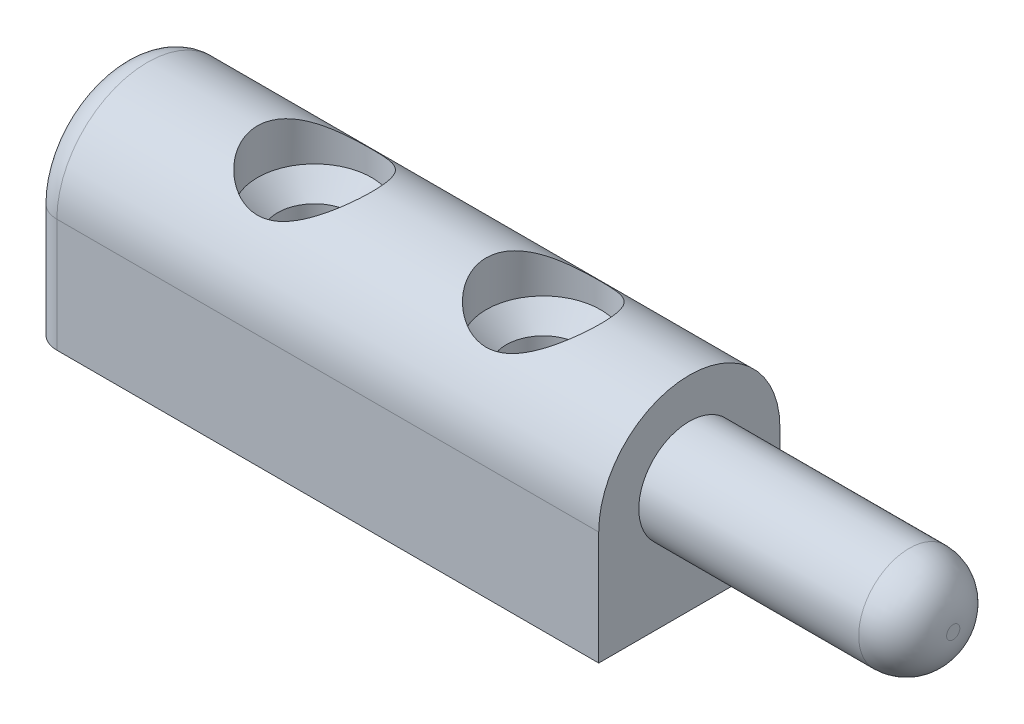
ISO-10303-21;
HEADER;
FILE_DESCRIPTION(('STEP AP214'),'2;1');
FILE_NAME('part.step','',(''),(''),'','','');
FILE_SCHEMA(('AUTOMOTIVE_DESIGN { 1 0 10303 214 1 1 1 1 }'));
ENDSEC;
DATA;
#1=APPLICATION_CONTEXT('core data for automotive mechanical design processes');
#2=APPLICATION_PROTOCOL_DEFINITION('international standard','automotive_design',2000,#1);
#3=PRODUCT_CONTEXT('',#1,'mechanical');
#4=PRODUCT('Part','Part','',(#3));
#5=PRODUCT_RELATED_PRODUCT_CATEGORY('part','',(#4));
#6=PRODUCT_DEFINITION_FORMATION('','',#4);
#7=PRODUCT_DEFINITION_CONTEXT('part definition',#1,'design');
#8=PRODUCT_DEFINITION('design','',#6,#7);
#9=PRODUCT_DEFINITION_SHAPE('','',#8);
#10=(LENGTH_UNIT() NAMED_UNIT(*) SI_UNIT(.MILLI.,.METRE.));
#11=(NAMED_UNIT(*) PLANE_ANGLE_UNIT() SI_UNIT($,.RADIAN.));
#12=(NAMED_UNIT(*) SI_UNIT($,.STERADIAN.) SOLID_ANGLE_UNIT());
#13=UNCERTAINTY_MEASURE_WITH_UNIT(LENGTH_MEASURE(1.E-05),#10,'distance_accuracy_value','');
#14=(GEOMETRIC_REPRESENTATION_CONTEXT(3) GLOBAL_UNCERTAINTY_ASSIGNED_CONTEXT((#13)) GLOBAL_UNIT_ASSIGNED_CONTEXT((#10,
#11,#12)) REPRESENTATION_CONTEXT('',''));
#15=CARTESIAN_POINT('',(0.,0.,0.));
#16=DIRECTION('',(0.,0.,1.));
#17=DIRECTION('',(1.,0.,0.));
#18=AXIS2_PLACEMENT_3D('',#15,#16,#17);
#19=CARTESIAN_POINT('',(16.15,0.,0.));
#20=DIRECTION('',(1.,0.,0.));
#21=DIRECTION('',(0.,0.,-1.));
#22=AXIS2_PLACEMENT_3D('',#19,#20,#21);
#23=PLANE('',#22);
#24=CARTESIAN_POINT('',(16.15,0.,0.));
#25=DIRECTION('',(1.,0.,0.));
#26=DIRECTION('',(0.,0.,-1.));
#27=AXIS2_PLACEMENT_3D('',#24,#25,#26);
#28=CIRCLE('',#27,5.15);
#29=CARTESIAN_POINT('',(16.15,0.,-5.15));
#30=VERTEX_POINT('',#29);
#31=CARTESIAN_POINT('',(16.15,0.,5.15));
#32=VERTEX_POINT('',#31);
#33=EDGE_CURVE('E93',#30,#32,#28,.T.);
#34=ORIENTED_EDGE('',*,*,#33,.T.);
#35=DIRECTION('',(0.,-1.,0.));
#36=VECTOR('',#35,1.);
#37=CARTESIAN_POINT('',(16.15,-6.45019379553824,5.15));
#38=LINE('',#37,#36);
#39=CARTESIAN_POINT('',(16.15,-6.45019379553824,5.15));
#40=VERTEX_POINT('',#39);
#41=EDGE_CURVE('E85',#32,#40,#38,.T.);
#42=ORIENTED_EDGE('',*,*,#41,.T.);
#43=DIRECTION('',(0.,0.,-1.));
#44=VECTOR('',#43,1.);
#45=CARTESIAN_POINT('',(16.15,-6.45019379553824,-5.15));
#46=LINE('',#45,#44);
#47=CARTESIAN_POINT('',(16.15,-6.45019379553824,-5.15));
#48=VERTEX_POINT('',#47);
#49=EDGE_CURVE('E92',#40,#48,#46,.T.);
#50=ORIENTED_EDGE('',*,*,#49,.T.);
#51=DIRECTION('',(0.,1.,0.));
#52=VECTOR('',#51,1.);
#53=CARTESIAN_POINT('',(16.15,-6.45019379553824,-5.15));
#54=LINE('',#53,#52);
#55=EDGE_CURVE('E98',#48,#30,#54,.T.);
#56=ORIENTED_EDGE('',*,*,#55,.T.);
#57=EDGE_LOOP('',(#34,#42,#50,#56));
#58=FACE_BOUND('',#57,.T.);
#59=CARTESIAN_POINT('',(16.15,0.,0.));
#60=DIRECTION('',(1.,0.,0.));
#61=DIRECTION('',(0.,0.,-1.));
#62=AXIS2_PLACEMENT_3D('',#59,#60,#61);
#63=CIRCLE('',#62,2.875);
#64=CARTESIAN_POINT('',(16.15,0.,-2.875));
#65=VERTEX_POINT('',#64);
#66=EDGE_CURVE('E221',#65,#65,#63,.T.);
#67=ORIENTED_EDGE('',*,*,#66,.F.);
#68=EDGE_LOOP('',(#67));
#69=FACE_BOUND('',#68,.T.);
#70=ADVANCED_FACE('F32',(#58,#69),#23,.T.);
#71=CARTESIAN_POINT('',(-5.15,5.15,0.));
#72=DIRECTION('',(0.,-1.,0.));
#73=DIRECTION('',(0.,0.,-1.));
#74=AXIS2_PLACEMENT_3D('',#71,#72,#73);
#75=CYLINDRICAL_SURFACE('',#74,3.25);
#76=CARTESIAN_POINT('',(-5.15,2.59980620446174,0.));
#77=DIRECTION('',(0.,1.,0.));
#78=DIRECTION('',(0.,0.,1.));
#79=AXIS2_PLACEMENT_3D('',#76,#77,#78);
#80=CIRCLE('',#79,3.25);
#81=CARTESIAN_POINT('',(-5.15,2.59980620446174,3.25));
#82=VERTEX_POINT('',#81);
#83=EDGE_CURVE('E138',#82,#82,#80,.F.);
#84=ORIENTED_EDGE('',*,*,#83,.T.);
#85=EDGE_LOOP('',(#84));
#86=FACE_BOUND('',#85,.T.);
#87=CARTESIAN_POINT('',(-8.4,5.15,0.));
#88=CARTESIAN_POINT('',(-8.40000001474633,5.15000000420325,-0.0824631102301969));
#89=CARTESIAN_POINT('',(-8.3968573318001,5.14801501046899,-0.164926473400708));
#90=CARTESIAN_POINT('',(-8.38433241643392,5.14012478994622,-0.329218697010087));
#91=CARTESIAN_POINT('',(-8.37494770422599,5.13421800513873,-0.41104729219725));
#92=CARTESIAN_POINT('',(-8.35005383138732,5.11861793148003,-0.573511125565467));
#93=CARTESIAN_POINT('',(-8.33453680503763,5.10891977973932,-0.654144692565212));
#94=CARTESIAN_POINT('',(-8.29759488640724,5.08597559790391,-0.81354337110015));
#95=CARTESIAN_POINT('',(-8.2761674940984,5.07272806652374,-0.892307676609958));
#96=CARTESIAN_POINT('',(-8.20365942007119,5.02825575256356,-1.12415930018388));
#97=CARTESIAN_POINT('',(-8.144196462155,4.99220026757494,-1.27379915933417));
#98=CARTESIAN_POINT('',(-8.00537866423584,4.91019990402799,-1.56036223857413));
#99=CARTESIAN_POINT('',(-7.926025406428,4.86425581211051,-1.69728646895532));
#100=CARTESIAN_POINT('',(-7.74260860328894,4.76186457025209,-1.96712720518533));
#101=CARTESIAN_POINT('',(-7.63706841971181,4.70486921425626,-2.09883009258909));
#102=CARTESIAN_POINT('',(-7.40768898358682,4.58774736224651,-2.34383547063853));
#103=CARTESIAN_POINT('',(-7.2838248768132,4.52761668642131,-2.457112523684));
#104=CARTESIAN_POINT('',(-7.00122572753084,4.40100825289756,-2.67805240181015));
#105=CARTESIAN_POINT('',(-6.84003698603885,4.33480612655313,-2.782760225939));
#106=CARTESIAN_POINT('',(-6.49848835881913,4.21344724270617,-2.9633135802799));
#107=CARTESIAN_POINT('',(-6.31816174791625,4.15827177977478,-3.03920818895198));
#108=CARTESIAN_POINT('',(-5.99169694782381,4.0804900475677,-3.14247212521559));
#109=CARTESIAN_POINT('',(-5.84907683187245,4.05313239488309,-3.17735920456733));
#110=CARTESIAN_POINT('',(-5.55848994938668,4.01326109216791,-3.227583887268));
#111=CARTESIAN_POINT('',(-5.4105312899255,4.00072583601166,-3.2429499482088));
#112=CARTESIAN_POINT('',(-5.112997859498,3.99239403063824,-3.25320544283478));
#113=CARTESIAN_POINT('',(-4.96341972393367,3.99664443701595,-3.24803743502481));
#114=CARTESIAN_POINT('',(-4.66766570982662,4.02130084823514,-3.21745197853596));
#115=CARTESIAN_POINT('',(-4.52149269204639,4.04171996643311,-3.19201809345977));
#116=CARTESIAN_POINT('',(-4.2400172137584,4.09504491191693,-3.12328558526757));
#117=CARTESIAN_POINT('',(-4.10453238768418,4.12761819525283,-3.08046026288364));
#118=CARTESIAN_POINT('',(-3.84241304726404,4.20165943027175,-2.97867616334199));
#119=CARTESIAN_POINT('',(-3.71578166182795,4.2431305056814,-2.91971171825145));
#120=CARTESIAN_POINT('',(-3.44943290141388,4.33978329186634,-2.77447913219011));
#121=CARTESIAN_POINT('',(-3.31178450207523,4.39607385047098,-2.68515416932122));
#122=CARTESIAN_POINT('',(-3.05192045361811,4.51091322124755,-2.48742559698068));
#123=CARTESIAN_POINT('',(-2.92972110648048,4.56946433515169,-2.37900211849673));
#124=CARTESIAN_POINT('',(-2.68272659983234,4.69405869220209,-2.12406525820927));
#125=CARTESIAN_POINT('',(-2.56108844713086,4.75966214299113,-1.97420825711635));
#126=CARTESIAN_POINT('',(-2.39895190164851,4.85039034030681,-1.7331023774508));
#127=CARTESIAN_POINT('',(-2.34827194569788,4.8793667444912,-1.64996583875332));
#128=CARTESIAN_POINT('',(-2.25420350413203,4.93398059514154,-1.47864631655992));
#129=CARTESIAN_POINT('',(-2.2108105261422,4.95962009657627,-1.39046648750907));
#130=CARTESIAN_POINT('',(-2.13387377975831,5.00560856281508,-1.21419081106441));
#131=CARTESIAN_POINT('',(-2.09994255907906,5.0261596732609,-1.12631678438055));
#132=CARTESIAN_POINT('',(-2.03965152965997,5.06297314341868,-0.947182435754095));
#133=CARTESIAN_POINT('',(-2.01328731635556,5.07923799759945,-0.855924118798911));
#134=CARTESIAN_POINT('',(-1.96856513510388,5.10697761199126,-0.670840945974958));
#135=CARTESIAN_POINT('',(-1.95019964650373,5.11845687133266,-0.577018589510138));
#136=CARTESIAN_POINT('',(-1.92178181218447,5.13626995915213,-0.387645929485478));
#137=CARTESIAN_POINT('',(-1.91172797917773,5.14260470818528,-0.292095938196906));
#138=CARTESIAN_POINT('',(-1.90100699432152,5.14936334380235,-0.114848262798944));
#139=CARTESIAN_POINT('',(-1.89914703020952,5.15053826613769,-0.0332485920114898));
#140=CARTESIAN_POINT('',(-1.90157085188034,5.14900871652198,0.129850620936838));
#141=CARTESIAN_POINT('',(-1.90585651048718,5.14630306199949,0.211350124996764));
#142=CARTESIAN_POINT('',(-1.92051250482943,5.13707664154087,0.373544633283652));
#143=CARTESIAN_POINT('',(-1.9308799739059,5.13055767301289,0.45423999832922));
#144=CARTESIAN_POINT('',(-1.95754591023973,5.11386923364644,0.614271754363318));
#145=CARTESIAN_POINT('',(-1.97384665933454,5.10369835836787,0.693607610200193));
#146=CARTESIAN_POINT('',(-2.02968399194461,5.06907481174538,0.921892246952387));
#147=CARTESIAN_POINT('',(-2.07685586762363,5.04005522052217,1.0683670465251));
#148=CARTESIAN_POINT('',(-2.19020089815807,4.97175800545943,1.35105353585945));
#149=CARTESIAN_POINT('',(-2.25637712320359,4.93247872423959,1.4872635628347));
#150=CARTESIAN_POINT('',(-2.41312016441514,4.8421067494015,1.76045283530246));
#151=CARTESIAN_POINT('',(-2.50546272207768,4.79022605945554,1.89615058772727));
#152=CARTESIAN_POINT('',(-2.70826039755557,4.68132146492193,2.15104444042241));
#153=CARTESIAN_POINT('',(-2.81873523511075,4.62429199150468,2.27022231129784));
#154=CARTESIAN_POINT('',(-3.07354600059857,4.50082357951378,2.50707794854023));
#155=CARTESIAN_POINT('',(-3.22047401728254,4.43424450478046,2.62190705829336));
#156=CARTESIAN_POINT('',(-3.53368178941835,4.30720909196768,2.82575198103522));
#157=CARTESIAN_POINT('',(-3.69995002912768,4.24674915007918,2.91478304579907));
#158=CARTESIAN_POINT('',(-4.01329219108341,4.15147135366619,3.04845714760913));
#159=CARTESIAN_POINT('',(-4.15723583979248,4.11393650415722,3.09847041932707));
#160=CARTESIAN_POINT('',(-4.45339172480452,4.05270166089385,3.17815454856359));
#161=CARTESIAN_POINT('',(-4.60559036319286,4.0289796279642,3.20785782516815));
#162=CARTESIAN_POINT('',(-4.91542595031955,3.99889777830263,3.24529527417289));
#163=CARTESIAN_POINT('',(-5.07309080957987,3.99264673565918,3.25289182246868));
#164=CARTESIAN_POINT('',(-5.38749968566356,3.99896069342075,3.24512408204794));
#165=CARTESIAN_POINT('',(-5.54424345840297,4.01153047384398,3.22975396037384));
#166=CARTESIAN_POINT('',(-5.83786646734055,4.05139703421064,3.17955333252038));
#167=CARTESIAN_POINT('',(-5.97527162378216,4.07728258415255,3.14657780573012));
#168=CARTESIAN_POINT('',(-6.24245632785395,4.13963170705416,3.06408395610837));
#169=CARTESIAN_POINT('',(-6.3722325154283,4.17609989960802,3.01455840733492));
#170=CARTESIAN_POINT('',(-6.64032680870774,4.2617723334145,2.89242084196274));
#171=CARTESIAN_POINT('',(-6.77725947207902,4.31204818172823,2.81753508506087));
#172=CARTESIAN_POINT('',(-7.03793040852022,4.41701590783482,2.64995429672589));
#173=CARTESIAN_POINT('',(-7.16165811947406,4.47171126007926,2.5572451726743));
#174=CARTESIAN_POINT('',(-7.41883204062406,4.59262206254264,2.33442353181078));
#175=CARTESIAN_POINT('',(-7.5490114309333,4.658884705436,2.20054049029774));
#176=CARTESIAN_POINT('',(-7.78588163280463,4.78516888297203,1.91040243487802));
#177=CARTESIAN_POINT('',(-7.89255619330085,4.84518608452686,1.7541320649558));
#178=CARTESIAN_POINT('',(-8.03246744704932,4.92617225366745,1.50437796500597));
#179=CARTESIAN_POINT('',(-8.07595260382513,4.95178633229026,1.41800580481927));
#180=CARTESIAN_POINT('',(-8.15536068698512,4.99911701166789,1.24085159312692));
#181=CARTESIAN_POINT('',(-8.19128795581493,5.02083584940125,1.15007211099211));
#182=CARTESIAN_POINT('',(-8.25496464717581,5.05966121416014,0.965011573760283));
#183=CARTESIAN_POINT('',(-8.28273551451489,5.07677982582297,0.870740448203342));
#184=CARTESIAN_POINT('',(-8.3297245418602,5.10590901189784,0.679371822175137));
#185=CARTESIAN_POINT('',(-8.34894880079841,5.11792322857695,0.582276390040328));
#186=CARTESIAN_POINT('',(-8.37575663016384,5.13472688252045,0.404381762569928));
#187=CARTESIAN_POINT('',(-8.38483591786194,5.14044180345248,0.323891462395923));
#188=CARTESIAN_POINT('',(-8.39695777036476,5.14807846998466,0.162267547759085));
#189=CARTESIAN_POINT('',(-8.39999998549136,5.1499999958645,0.0811338963054418));
#190=CARTESIAN_POINT('',(-8.4,5.15,0.));
#191=B_SPLINE_CURVE_WITH_KNOTS('',3,(#87,#88,#89,#90,#91,#92,#93,#94,#95,#96,#97,#98,#99,#100,
#101,#102,#103,#104,#105,#106,#107,#108,#109,#110,#111,#112,#113,#114,#115,#116,#117,#118,#119,
#120,#121,#122,#123,#124,#125,#126,#127,#128,#129,#130,#131,#132,#133,#134,#135,#136,#137,#138,
#139,#140,#141,#142,#143,#144,#145,#146,#147,#148,#149,#150,#151,#152,#153,#154,#155,#156,#157,
#158,#159,#160,#161,#162,#163,#164,#165,#166,#167,#168,#169,#170,#171,#172,#173,#174,#175,#176,
#177,#178,#179,#180,#181,#182,#183,#184,#185,#186,#187,#188,#189,#190),.UNSPECIFIED.,.T.,.F.,(4,
2,2,2,2,2,2,2,2,2,2,2,2,2,2,2,2,2,2,2,2,2,2,2,2,2,2,2,2,2,2,2,2,2,2,2,2,2,2,2,2,2,2,2,2,2,2,2,2,
2,2,4),(0.,0.247306259755544,0.494710826272477,0.742433765900136,0.990261651070475,1.4829230381,
1.97554524828364,2.50789333177357,3.04097021751406,3.64794338697618,4.25387799107259,
4.70008670221317,5.14564418445023,5.59244893444222,6.03961642938152,6.47535288295667,
6.9112425605263,7.42975088559886,7.9488018580119,8.55697602201866,8.86138229384837,
9.16560020670763,9.45441443853258,9.74306021633956,10.031434011304,10.3197561934858,
10.564329867415,10.8089780888433,11.0535110879798,11.2981382298385,11.765780099064,
12.2334975592957,12.7479216065956,13.2629088680205,13.8543403388998,14.4454214394186,
14.9143983289138,15.3826248726454,15.8537601614703,16.32501512717,16.7543016838095,
17.1837759176324,17.6739553771918,18.1645240188811,18.7563673635887,19.3486186293001,
19.64834578597,19.9479002587718,20.2466599440773,20.545206088383,20.7885119530726,
21.0318319100653),.UNSPECIFIED.);
#192=CARTESIAN_POINT('',(-8.4,5.15,0.));
#193=VERTEX_POINT('',#192);
#194=EDGE_CURVE('E127',#193,#193,#191,.T.);
#195=ORIENTED_EDGE('',*,*,#194,.F.);
#196=EDGE_LOOP('',(#195));
#197=FACE_BOUND('',#196,.T.);
#198=ADVANCED_FACE('F154',(#86,#197),#75,.F.);
#199=CARTESIAN_POINT('',(7.85,5.15,0.));
#200=DIRECTION('',(0.,-1.,0.));
#201=DIRECTION('',(0.,0.,-1.));
#202=AXIS2_PLACEMENT_3D('',#199,#200,#201);
#203=CYLINDRICAL_SURFACE('',#202,3.25);
#204=CARTESIAN_POINT('',(7.85,2.59980620446174,0.));
#205=DIRECTION('',(0.,1.,0.));
#206=DIRECTION('',(0.,0.,1.));
#207=AXIS2_PLACEMENT_3D('',#204,#205,#206);
#208=CIRCLE('',#207,3.25);
#209=CARTESIAN_POINT('',(7.85,2.59980620446174,3.25));
#210=VERTEX_POINT('',#209);
#211=EDGE_CURVE('E135',#210,#210,#208,.F.);
#212=ORIENTED_EDGE('',*,*,#211,.T.);
#213=EDGE_LOOP('',(#212));
#214=FACE_BOUND('',#213,.T.);
#215=CARTESIAN_POINT('',(4.6,5.15,0.));
#216=CARTESIAN_POINT('',(4.59999998525367,5.15000000420325,-0.0824631102301968));
#217=CARTESIAN_POINT('',(4.6031426681999,5.14801501046899,-0.164926473400708));
#218=CARTESIAN_POINT('',(4.61566758356608,5.14012478994622,-0.329218697010087));
#219=CARTESIAN_POINT('',(4.62505229577401,5.13421800513873,-0.41104729219725));
#220=CARTESIAN_POINT('',(4.64994616861268,5.11861793148003,-0.573511125565466));
#221=CARTESIAN_POINT('',(4.66546319496237,5.10891977973932,-0.654144692565212));
#222=CARTESIAN_POINT('',(4.70240511359276,5.08597559790391,-0.81354337110015));
#223=CARTESIAN_POINT('',(4.7238325059016,5.07272806652374,-0.892307676609958));
#224=CARTESIAN_POINT('',(4.79634057992881,5.02825575256356,-1.12415930018388));
#225=CARTESIAN_POINT('',(4.855803537845,4.99220026757494,-1.27379915933417));
#226=CARTESIAN_POINT('',(4.99462133576416,4.91019990402799,-1.56036223857413));
#227=CARTESIAN_POINT('',(5.073974593572,4.86425581211051,-1.69728646895532));
#228=CARTESIAN_POINT('',(5.25739139671106,4.76186457025209,-1.96712720518533));
#229=CARTESIAN_POINT('',(5.36293158028819,4.70486921425627,-2.09883009258909));
#230=CARTESIAN_POINT('',(5.59231101641318,4.58774736224651,-2.34383547063853));
#231=CARTESIAN_POINT('',(5.7161751231868,4.52761668642131,-2.457112523684));
#232=CARTESIAN_POINT('',(5.99877427246916,4.40100825289756,-2.67805240181015));
#233=CARTESIAN_POINT('',(6.15996301396115,4.33480612655313,-2.782760225939));
#234=CARTESIAN_POINT('',(6.50151164118087,4.21344724270617,-2.9633135802799));
#235=CARTESIAN_POINT('',(6.68183825208375,4.15827177977478,-3.03920818895198));
#236=CARTESIAN_POINT('',(7.00830305217619,4.0804900475677,-3.14247212521559));
#237=CARTESIAN_POINT('',(7.15092316812755,4.05313239488309,-3.17735920456733));
#238=CARTESIAN_POINT('',(7.44151005061332,4.01326109216791,-3.227583887268));
#239=CARTESIAN_POINT('',(7.5894687100745,4.00072583601166,-3.2429499482088));
#240=CARTESIAN_POINT('',(7.887002140502,3.99239403063824,-3.25320544283478));
#241=CARTESIAN_POINT('',(8.03658027606633,3.99664443701595,-3.24803743502481));
#242=CARTESIAN_POINT('',(8.33233429017339,4.02130084823514,-3.21745197853596));
#243=CARTESIAN_POINT('',(8.47850730795361,4.04171996643311,-3.19201809345977));
#244=CARTESIAN_POINT('',(8.7599827862416,4.09504491191693,-3.12328558526757));
#245=CARTESIAN_POINT('',(8.89546761231582,4.12761819525283,-3.08046026288364));
#246=CARTESIAN_POINT('',(9.15758695273597,4.20165943027176,-2.97867616334199));
#247=CARTESIAN_POINT('',(9.28421833817205,4.2431305056814,-2.91971171825144));
#248=CARTESIAN_POINT('',(9.55056709858612,4.33978329186634,-2.77447913219011));
#249=CARTESIAN_POINT('',(9.68821549792477,4.39607385047098,-2.68515416932122));
#250=CARTESIAN_POINT('',(9.94807954638189,4.51091322124755,-2.48742559698068));
#251=CARTESIAN_POINT('',(10.0702788935195,4.56946433515169,-2.37900211849673));
#252=CARTESIAN_POINT('',(10.3172734001677,4.69405869220209,-2.12406525820926));
#253=CARTESIAN_POINT('',(10.4389115528691,4.75966214299113,-1.97420825711635));
#254=CARTESIAN_POINT('',(10.6010480983515,4.85039034030681,-1.7331023774508));
#255=CARTESIAN_POINT('',(10.6517280543021,4.8793667444912,-1.64996583875332));
#256=CARTESIAN_POINT('',(10.745796495868,4.93398059514154,-1.47864631655992));
#257=CARTESIAN_POINT('',(10.7891894738578,4.95962009657627,-1.39046648750907));
#258=CARTESIAN_POINT('',(10.8661262202417,5.00560856281508,-1.21419081106441));
#259=CARTESIAN_POINT('',(10.9000574409209,5.0261596732609,-1.12631678438054));
#260=CARTESIAN_POINT('',(10.96034847034,5.06297314341868,-0.947182435754091));
#261=CARTESIAN_POINT('',(10.9867126836444,5.07923799759945,-0.855924118798907));
#262=CARTESIAN_POINT('',(11.0314348648961,5.10697761199126,-0.670840945974954));
#263=CARTESIAN_POINT('',(11.0498003534963,5.11845687133266,-0.577018589510134));
#264=CARTESIAN_POINT('',(11.0782181878155,5.13626995915213,-0.387645929485476));
#265=CARTESIAN_POINT('',(11.0882720208223,5.14260470818528,-0.292095938196903));
#266=CARTESIAN_POINT('',(11.0989930056785,5.14936334380235,-0.114848262798942));
#267=CARTESIAN_POINT('',(11.1008529697905,5.15053826613769,-0.033248592011489));
#268=CARTESIAN_POINT('',(11.0984291481197,5.14900871652198,0.129850620936838));
#269=CARTESIAN_POINT('',(11.0941434895128,5.14630306199949,0.211350124996765));
#270=CARTESIAN_POINT('',(11.0794874951706,5.13707664154087,0.373544633283653));
#271=CARTESIAN_POINT('',(11.0691200260941,5.13055767301289,0.454239998329222));
#272=CARTESIAN_POINT('',(11.0424540897603,5.11386923364644,0.61427175436332));
#273=CARTESIAN_POINT('',(11.0261533406655,5.10369835836787,0.693607610200195));
#274=CARTESIAN_POINT('',(10.9703160080554,5.06907481174538,0.921892246952389));
#275=CARTESIAN_POINT('',(10.9231441323764,5.04005522052217,1.0683670465251));
#276=CARTESIAN_POINT('',(10.8097991018419,4.97175800545943,1.35105353585946));
#277=CARTESIAN_POINT('',(10.7436228767964,4.93247872423959,1.4872635628347));
#278=CARTESIAN_POINT('',(10.5868798355849,4.8421067494015,1.76045283530246));
#279=CARTESIAN_POINT('',(10.4945372779223,4.79022605945554,1.89615058772727));
#280=CARTESIAN_POINT('',(10.2917396024444,4.68132146492193,2.15104444042241));
#281=CARTESIAN_POINT('',(10.1812647648892,4.62429199150468,2.27022231129784));
#282=CARTESIAN_POINT('',(9.92645399940142,4.50082357951378,2.50707794854024));
#283=CARTESIAN_POINT('',(9.77952598271746,4.43424450478046,2.62190705829336));
#284=CARTESIAN_POINT('',(9.46631821058165,4.30720909196768,2.82575198103522));
#285=CARTESIAN_POINT('',(9.30004997087232,4.24674915007918,2.91478304579907));
#286=CARTESIAN_POINT('',(8.98670780891658,4.15147135366619,3.04845714760913));
#287=CARTESIAN_POINT('',(8.84276416020751,4.11393650415722,3.09847041932707));
#288=CARTESIAN_POINT('',(8.54660827519547,4.05270166089385,3.17815454856359));
#289=CARTESIAN_POINT('',(8.39440963680714,4.0289796279642,3.20785782516815));
#290=CARTESIAN_POINT('',(8.08457404968045,3.99889777830263,3.24529527417289));
#291=CARTESIAN_POINT('',(7.92690919042013,3.99264673565918,3.25289182246868));
#292=CARTESIAN_POINT('',(7.61250031433643,3.99896069342075,3.24512408204794));
#293=CARTESIAN_POINT('',(7.45575654159703,4.01153047384398,3.22975396037383));
#294=CARTESIAN_POINT('',(7.16213353265944,4.05139703421064,3.17955333252038));
#295=CARTESIAN_POINT('',(7.02472837621783,4.07728258415256,3.14657780573012));
#296=CARTESIAN_POINT('',(6.75754367214604,4.13963170705417,3.06408395610836));
#297=CARTESIAN_POINT('',(6.62776748457169,4.17609989960802,3.01455840733492));
#298=CARTESIAN_POINT('',(6.35967319129225,4.2617723334145,2.89242084196273));
#299=CARTESIAN_POINT('',(6.22274052792098,4.31204818172823,2.81753508506087));
#300=CARTESIAN_POINT('',(5.96206959147977,4.41701590783482,2.64995429672589));
#301=CARTESIAN_POINT('',(5.83834188052594,4.47171126007926,2.55724517267429));
#302=CARTESIAN_POINT('',(5.58116795937593,4.59262206254265,2.33442353181078));
#303=CARTESIAN_POINT('',(5.45098856906669,4.65888470543601,2.20054049029774));
#304=CARTESIAN_POINT('',(5.21411836719537,4.78516888297203,1.91040243487801));
#305=CARTESIAN_POINT('',(5.10744380669914,4.84518608452686,1.7541320649558));
#306=CARTESIAN_POINT('',(4.96753255295067,4.92617225366745,1.50437796500596));
#307=CARTESIAN_POINT('',(4.92404739617487,4.95178633229026,1.41800580481926));
#308=CARTESIAN_POINT('',(4.84463931301487,4.99911701166789,1.24085159312691));
#309=CARTESIAN_POINT('',(4.80871204418507,5.02083584940126,1.15007211099211));
#310=CARTESIAN_POINT('',(4.74503535282419,5.05966121416014,0.965011573760276));
#311=CARTESIAN_POINT('',(4.7172644854851,5.07677982582298,0.870740448203335));
#312=CARTESIAN_POINT('',(4.6702754581398,5.10590901189784,0.679371822175131));
#313=CARTESIAN_POINT('',(4.65105119920159,5.11792322857695,0.582276390040322));
#314=CARTESIAN_POINT('',(4.62424336983616,5.13472688252045,0.404381762569924));
#315=CARTESIAN_POINT('',(4.61516408213806,5.14044180345248,0.323891462395921));
#316=CARTESIAN_POINT('',(4.60304222963524,5.14807846998466,0.162267547759086));
#317=CARTESIAN_POINT('',(4.60000001450864,5.1499999958645,0.0811338963054419));
#318=CARTESIAN_POINT('',(4.6,5.15,0.));
#319=B_SPLINE_CURVE_WITH_KNOTS('',3,(#215,#216,#217,#218,#219,#220,#221,#222,#223,#224,#225,
#226,#227,#228,#229,#230,#231,#232,#233,#234,#235,#236,#237,#238,#239,#240,#241,#242,#243,#244,
#245,#246,#247,#248,#249,#250,#251,#252,#253,#254,#255,#256,#257,#258,#259,#260,#261,#262,#263,
#264,#265,#266,#267,#268,#269,#270,#271,#272,#273,#274,#275,#276,#277,#278,#279,#280,#281,#282,
#283,#284,#285,#286,#287,#288,#289,#290,#291,#292,#293,#294,#295,#296,#297,#298,#299,#300,#301,
#302,#303,#304,#305,#306,#307,#308,#309,#310,#311,#312,#313,#314,#315,#316,#317,#318),
.UNSPECIFIED.,.T.,.F.,(4,2,2,2,2,2,2,2,2,2,2,2,2,2,2,2,2,2,2,2,2,2,2,2,2,2,2,2,2,2,2,2,2,2,2,2,
2,2,2,2,2,2,2,2,2,2,2,2,2,2,2,4),(0.,0.247306259755544,0.494710826272477,0.742433765900136,
0.990261651070474,1.4829230381,1.97554524828364,2.50789333177357,3.04097021751406,
3.64794338697618,4.25387799107259,4.70008670221317,5.14564418445023,5.59244893444222,
6.03961642938153,6.47535288295667,6.9112425605263,7.42975088559886,7.94880185801191,
8.55697602201867,8.86138229384837,9.16560020670763,9.45441443853258,9.74306021633956,
10.031434011304,10.3197561934858,10.564329867415,10.8089780888433,11.0535110879798,
11.2981382298385,11.765780099064,12.2334975592957,12.7479216065956,13.2629088680205,
13.8543403388998,14.4454214394186,14.9143983289138,15.3826248726454,15.8537601614703,
16.32501512717,16.7543016838095,17.1837759176324,17.6739553771918,18.1645240188811,
18.7563673635887,19.3486186293002,19.64834578597,19.9479002587718,20.2466599440773,
20.545206088383,20.7885119530726,21.0318319100653),.UNSPECIFIED.);
#320=CARTESIAN_POINT('',(4.6,5.15,0.));
#321=VERTEX_POINT('',#320);
#322=EDGE_CURVE('E191',#321,#321,#319,.T.);
#323=ORIENTED_EDGE('',*,*,#322,.F.);
#324=EDGE_LOOP('',(#323));
#325=FACE_BOUND('',#324,.T.);
#326=ADVANCED_FACE('F159',(#214,#325),#203,.F.);
#327=CARTESIAN_POINT('',(-16.15,0.,0.));
#328=DIRECTION('',(1.,0.,0.));
#329=DIRECTION('',(0.,0.,-1.));
#330=AXIS2_PLACEMENT_3D('',#327,#328,#329);
#331=PLANE('',#330);
#332=CARTESIAN_POINT('',(-16.15,0.,0.));
#333=DIRECTION('',(1.,0.,0.));
#334=DIRECTION('',(0.,0.,-1.));
#335=AXIS2_PLACEMENT_3D('',#332,#333,#334);
#336=CIRCLE('',#335,3.65);
#337=CARTESIAN_POINT('',(-16.15,0.,3.65));
#338=VERTEX_POINT('',#337);
#339=CARTESIAN_POINT('',(-16.15,0.,-3.65));
#340=VERTEX_POINT('',#339);
#341=EDGE_CURVE('E106',#338,#340,#336,.F.);
#342=ORIENTED_EDGE('',*,*,#341,.T.);
#343=DIRECTION('',(0.,1.,0.));
#344=VECTOR('',#343,1.);
#345=CARTESIAN_POINT('',(-16.15,0.,-3.65));
#346=LINE('',#345,#344);
#347=CARTESIAN_POINT('',(-16.15,-6.45019379553824,-3.65));
#348=VERTEX_POINT('',#347);
#349=EDGE_CURVE('E115',#340,#348,#346,.F.);
#350=ORIENTED_EDGE('',*,*,#349,.T.);
#351=DIRECTION('',(0.,0.,-1.));
#352=VECTOR('',#351,1.);
#353=CARTESIAN_POINT('',(-16.15,-6.45019379553824,-5.15));
#354=LINE('',#353,#352);
#355=CARTESIAN_POINT('',(-16.15,-6.45019379553824,3.65));
#356=VERTEX_POINT('',#355);
#357=EDGE_CURVE('E100',#356,#348,#354,.T.);
#358=ORIENTED_EDGE('',*,*,#357,.F.);
#359=DIRECTION('',(0.,-1.,0.));
#360=VECTOR('',#359,1.);
#361=CARTESIAN_POINT('',(-16.15,0.,3.65));
#362=LINE('',#361,#360);
#363=EDGE_CURVE('E113',#356,#338,#362,.F.);
#364=ORIENTED_EDGE('',*,*,#363,.T.);
#365=EDGE_LOOP('',(#342,#350,#358,#364));
#366=FACE_BOUND('',#365,.T.);
#367=ADVANCED_FACE('F165',(#366),#331,.F.);
#368=CARTESIAN_POINT('',(16.15,0.,0.));
#369=DIRECTION('',(-1.,0.,0.));
#370=DIRECTION('',(0.,0.,1.));
#371=AXIS2_PLACEMENT_3D('',#368,#369,#370);
#372=CYLINDRICAL_SURFACE('',#371,5.15);
#373=ORIENTED_EDGE('',*,*,#322,.T.);
#374=EDGE_LOOP('',(#373));
#375=FACE_BOUND('',#374,.T.);
#376=ORIENTED_EDGE('',*,*,#194,.T.);
#377=EDGE_LOOP('',(#376));
#378=FACE_BOUND('',#377,.T.);
#379=DIRECTION('',(-1.,0.,0.));
#380=VECTOR('',#379,1.);
#381=CARTESIAN_POINT('',(16.15,0.,-5.15));
#382=LINE('',#381,#380);
#383=CARTESIAN_POINT('',(-14.65,0.,-5.15));
#384=VERTEX_POINT('',#383);
#385=EDGE_CURVE('E262',#30,#384,#382,.T.);
#386=ORIENTED_EDGE('',*,*,#385,.T.);
#387=CARTESIAN_POINT('',(-14.65,0.,0.));
#388=DIRECTION('',(1.,0.,0.));
#389=DIRECTION('',(0.,0.,-1.));
#390=AXIS2_PLACEMENT_3D('',#387,#388,#389);
#391=CIRCLE('',#390,5.15);
#392=CARTESIAN_POINT('',(-14.65,0.,5.15));
#393=VERTEX_POINT('',#392);
#394=EDGE_CURVE('E47',#384,#393,#391,.T.);
#395=ORIENTED_EDGE('',*,*,#394,.T.);
#396=DIRECTION('',(-1.,0.,0.));
#397=VECTOR('',#396,1.);
#398=CARTESIAN_POINT('',(16.15,0.,5.15));
#399=LINE('',#398,#397);
#400=EDGE_CURVE('E88',#32,#393,#399,.T.);
#401=ORIENTED_EDGE('',*,*,#400,.F.);
#402=ORIENTED_EDGE('',*,*,#33,.F.);
#403=EDGE_LOOP('',(#386,#395,#401,#402));
#404=FACE_BOUND('',#403,.T.);
#405=ADVANCED_FACE('F102',(#375,#378,#404),#372,.T.);
#406=CARTESIAN_POINT('',(16.15,-6.45019379553824,5.15));
#407=DIRECTION('',(0.,0.,-1.));
#408=DIRECTION('',(0.,1.,0.));
#409=AXIS2_PLACEMENT_3D('',#406,#407,#408);
#410=PLANE('',#409);
#411=ORIENTED_EDGE('',*,*,#400,.T.);
#412=DIRECTION('',(0.,-1.,0.));
#413=VECTOR('',#412,1.);
#414=CARTESIAN_POINT('',(-14.65,-6.45019379553824,5.15));
#415=LINE('',#414,#413);
#416=CARTESIAN_POINT('',(-14.65,-6.45019379553824,5.15));
#417=VERTEX_POINT('',#416);
#418=EDGE_CURVE('E54',#393,#417,#415,.T.);
#419=ORIENTED_EDGE('',*,*,#418,.T.);
#420=DIRECTION('',(-1.,0.,0.));
#421=VECTOR('',#420,1.);
#422=CARTESIAN_POINT('',(16.15,-6.45019379553824,5.15));
#423=LINE('',#422,#421);
#424=EDGE_CURVE('E89',#40,#417,#423,.T.);
#425=ORIENTED_EDGE('',*,*,#424,.F.);
#426=ORIENTED_EDGE('',*,*,#41,.F.);
#427=EDGE_LOOP('',(#411,#419,#425,#426));
#428=FACE_BOUND('',#427,.T.);
#429=ADVANCED_FACE('F87',(#428),#410,.F.);
#430=CARTESIAN_POINT('',(16.15,-6.45019379553824,-5.15));
#431=DIRECTION('',(0.,1.,0.));
#432=DIRECTION('',(0.,0.,1.));
#433=AXIS2_PLACEMENT_3D('',#430,#431,#432);
#434=PLANE('',#433);
#435=ORIENTED_EDGE('',*,*,#357,.T.);
#436=CARTESIAN_POINT('',(-14.65,-6.45019379553824,-3.65));
#437=DIRECTION('',(0.,1.,0.));
#438=DIRECTION('',(0.,0.,1.));
#439=AXIS2_PLACEMENT_3D('',#436,#437,#438);
#440=CIRCLE('',#439,1.5);
#441=CARTESIAN_POINT('',(-14.65,-6.45019379553824,-5.15));
#442=VERTEX_POINT('',#441);
#443=EDGE_CURVE('E119',#348,#442,#440,.F.);
#444=ORIENTED_EDGE('',*,*,#443,.T.);
#445=DIRECTION('',(-1.,0.,0.));
#446=VECTOR('',#445,1.);
#447=CARTESIAN_POINT('',(16.15,-6.45019379553824,-5.15));
#448=LINE('',#447,#446);
#449=EDGE_CURVE('E108',#48,#442,#448,.T.);
#450=ORIENTED_EDGE('',*,*,#449,.F.);
#451=ORIENTED_EDGE('',*,*,#49,.F.);
#452=ORIENTED_EDGE('',*,*,#424,.T.);
#453=CARTESIAN_POINT('',(-14.65,-6.45019379553824,3.65));
#454=DIRECTION('',(0.,1.,0.));
#455=DIRECTION('',(0.,0.,1.));
#456=AXIS2_PLACEMENT_3D('',#453,#454,#455);
#457=CIRCLE('',#456,1.5);
#458=EDGE_CURVE('E117',#417,#356,#457,.F.);
#459=ORIENTED_EDGE('',*,*,#458,.T.);
#460=EDGE_LOOP('',(#435,#444,#450,#451,#452,#459));
#461=FACE_BOUND('',#460,.T.);
#462=CARTESIAN_POINT('',(7.85,-6.45019379553824,0.));
#463=DIRECTION('',(0.,-1.,0.));
#464=DIRECTION('',(0.,0.,-1.));
#465=AXIS2_PLACEMENT_3D('',#462,#463,#464);
#466=CIRCLE('',#465,2.1);
#467=CARTESIAN_POINT('',(7.85,-6.45019379553824,-2.1));
#468=VERTEX_POINT('',#467);
#469=EDGE_CURVE('E196',#468,#468,#466,.T.);
#470=ORIENTED_EDGE('',*,*,#469,.F.);
#471=EDGE_LOOP('',(#470));
#472=FACE_BOUND('',#471,.T.);
#473=CARTESIAN_POINT('',(-5.15,-6.45019379553824,0.));
#474=DIRECTION('',(0.,-1.,0.));
#475=DIRECTION('',(0.,0.,-1.));
#476=AXIS2_PLACEMENT_3D('',#473,#474,#475);
#477=CIRCLE('',#476,2.1);
#478=CARTESIAN_POINT('',(-5.15,-6.45019379553824,-2.1));
#479=VERTEX_POINT('',#478);
#480=EDGE_CURVE('E222',#479,#479,#477,.T.);
#481=ORIENTED_EDGE('',*,*,#480,.F.);
#482=EDGE_LOOP('',(#481));
#483=FACE_BOUND('',#482,.T.);
#484=ADVANCED_FACE('F173',(#461,#472,#483),#434,.F.);
#485=CARTESIAN_POINT('',(16.15,-6.45019379553824,-5.15));
#486=DIRECTION('',(0.,0.,1.));
#487=DIRECTION('',(0.,-1.,0.));
#488=AXIS2_PLACEMENT_3D('',#485,#486,#487);
#489=PLANE('',#488);
#490=ORIENTED_EDGE('',*,*,#449,.T.);
#491=DIRECTION('',(0.,1.,0.));
#492=VECTOR('',#491,1.);
#493=CARTESIAN_POINT('',(-14.65,-6.45019379553824,-5.15));
#494=LINE('',#493,#492);
#495=EDGE_CURVE('E103',#442,#384,#494,.T.);
#496=ORIENTED_EDGE('',*,*,#495,.T.);
#497=ORIENTED_EDGE('',*,*,#385,.F.);
#498=ORIENTED_EDGE('',*,*,#55,.F.);
#499=EDGE_LOOP('',(#490,#496,#497,#498));
#500=FACE_BOUND('',#499,.T.);
#501=ADVANCED_FACE('F169',(#500),#489,.F.);
#502=CARTESIAN_POINT('',(-14.65,-6.45019379553824,3.65));
#503=DIRECTION('',(0.,-1.,0.));
#504=DIRECTION('',(0.,0.,-1.));
#505=AXIS2_PLACEMENT_3D('',#502,#503,#504);
#506=CYLINDRICAL_SURFACE('',#505,1.5);
#507=ORIENTED_EDGE('',*,*,#458,.F.);
#508=ORIENTED_EDGE('',*,*,#418,.F.);
#509=CARTESIAN_POINT('',(-14.65,0.,3.65));
#510=DIRECTION('',(0.,1.,0.));
#511=DIRECTION('',(0.,0.,1.));
#512=AXIS2_PLACEMENT_3D('',#509,#510,#511);
#513=CIRCLE('',#512,1.5);
#514=EDGE_CURVE('E126',#338,#393,#513,.T.);
#515=ORIENTED_EDGE('',*,*,#514,.F.);
#516=ORIENTED_EDGE('',*,*,#363,.F.);
#517=EDGE_LOOP('',(#507,#508,#515,#516));
#518=FACE_BOUND('',#517,.T.);
#519=ADVANCED_FACE('F172',(#518),#506,.T.);
#520=CARTESIAN_POINT('',(-14.65,0.,0.));
#521=DIRECTION('',(1.,0.,0.));
#522=DIRECTION('',(0.,0.,-1.));
#523=AXIS2_PLACEMENT_3D('',#520,#521,#522);
#524=TOROIDAL_SURFACE('',#523,3.65,1.5);
#525=ORIENTED_EDGE('',*,*,#514,.T.);
#526=ORIENTED_EDGE('',*,*,#394,.F.);
#527=CARTESIAN_POINT('',(-14.65,0.,-3.65));
#528=DIRECTION('',(0.,-1.,0.));
#529=DIRECTION('',(0.,0.,-1.));
#530=AXIS2_PLACEMENT_3D('',#527,#528,#529);
#531=CIRCLE('',#530,1.5);
#532=EDGE_CURVE('E124',#340,#384,#531,.T.);
#533=ORIENTED_EDGE('',*,*,#532,.F.);
#534=ORIENTED_EDGE('',*,*,#341,.F.);
#535=EDGE_LOOP('',(#525,#526,#533,#534));
#536=FACE_BOUND('',#535,.T.);
#537=ADVANCED_FACE('F241',(#536),#524,.T.);
#538=CARTESIAN_POINT('',(-14.65,-6.45019379553824,-3.65));
#539=DIRECTION('',(0.,1.,0.));
#540=DIRECTION('',(0.,0.,1.));
#541=AXIS2_PLACEMENT_3D('',#538,#539,#540);
#542=CYLINDRICAL_SURFACE('',#541,1.5);
#543=ORIENTED_EDGE('',*,*,#443,.F.);
#544=ORIENTED_EDGE('',*,*,#349,.F.);
#545=ORIENTED_EDGE('',*,*,#532,.T.);
#546=ORIENTED_EDGE('',*,*,#495,.F.);
#547=EDGE_LOOP('',(#543,#544,#545,#546));
#548=FACE_BOUND('',#547,.T.);
#549=ADVANCED_FACE('F184',(#548),#542,.T.);
#550=CARTESIAN_POINT('',(7.85,2.64980620446176,0.));
#551=DIRECTION('',(0.,-1.,0.));
#552=DIRECTION('',(0.,0.,-1.));
#553=AXIS2_PLACEMENT_3D('',#550,#551,#552);
#554=CYLINDRICAL_SURFACE('',#553,2.1);
#555=CARTESIAN_POINT('',(7.85,1.44980620446175,0.));
#556=DIRECTION('',(0.,-1.,0.));
#557=DIRECTION('',(0.,0.,-1.));
#558=AXIS2_PLACEMENT_3D('',#555,#556,#557);
#559=CIRCLE('',#558,2.1);
#560=CARTESIAN_POINT('',(7.85,1.44980620446175,-2.1));
#561=VERTEX_POINT('',#560);
#562=EDGE_CURVE('E123',#561,#561,#559,.F.);
#563=ORIENTED_EDGE('',*,*,#562,.T.);
#564=EDGE_LOOP('',(#563));
#565=FACE_BOUND('',#564,.T.);
#566=ORIENTED_EDGE('',*,*,#469,.T.);
#567=EDGE_LOOP('',(#566));
#568=FACE_BOUND('',#567,.T.);
#569=ADVANCED_FACE('F202',(#565,#568),#554,.F.);
#570=CARTESIAN_POINT('',(-5.15,2.64980620446176,0.));
#571=DIRECTION('',(0.,-1.,0.));
#572=DIRECTION('',(0.,0.,-1.));
#573=AXIS2_PLACEMENT_3D('',#570,#571,#572);
#574=CYLINDRICAL_SURFACE('',#573,2.1);
#575=CARTESIAN_POINT('',(-5.15,1.44980620446175,0.));
#576=DIRECTION('',(0.,-1.,0.));
#577=DIRECTION('',(0.,0.,-1.));
#578=AXIS2_PLACEMENT_3D('',#575,#576,#577);
#579=CIRCLE('',#578,2.1);
#580=CARTESIAN_POINT('',(-5.15,1.44980620446175,-2.1));
#581=VERTEX_POINT('',#580);
#582=EDGE_CURVE('E132',#581,#581,#579,.F.);
#583=ORIENTED_EDGE('',*,*,#582,.T.);
#584=EDGE_LOOP('',(#583));
#585=FACE_BOUND('',#584,.T.);
#586=ORIENTED_EDGE('',*,*,#480,.T.);
#587=EDGE_LOOP('',(#586));
#588=FACE_BOUND('',#587,.T.);
#589=ADVANCED_FACE('F205',(#585,#588),#574,.F.);
#590=CARTESIAN_POINT('',(7.85,2.64980620446176,0.));
#591=DIRECTION('',(0.,1.,0.));
#592=DIRECTION('',(0.,0.,1.));
#593=AXIS2_PLACEMENT_3D('',#590,#591,#592);
#594=CONICAL_SURFACE('',#593,3.30000000000002,0.785398163397454);
#595=ORIENTED_EDGE('',*,*,#562,.F.);
#596=EDGE_LOOP('',(#595));
#597=FACE_BOUND('',#596,.T.);
#598=ORIENTED_EDGE('',*,*,#211,.F.);
#599=EDGE_LOOP('',(#598));
#600=FACE_BOUND('',#599,.T.);
#601=ADVANCED_FACE('F209',(#597,#600),#594,.F.);
#602=CARTESIAN_POINT('',(-5.15,2.64980620446176,0.));
#603=DIRECTION('',(0.,1.,0.));
#604=DIRECTION('',(0.,0.,1.));
#605=AXIS2_PLACEMENT_3D('',#602,#603,#604);
#606=CONICAL_SURFACE('',#605,3.30000000000002,0.785398163397454);
#607=ORIENTED_EDGE('',*,*,#582,.F.);
#608=EDGE_LOOP('',(#607));
#609=FACE_BOUND('',#608,.T.);
#610=ORIENTED_EDGE('',*,*,#83,.F.);
#611=EDGE_LOOP('',(#610));
#612=FACE_BOUND('',#611,.T.);
#613=ADVANCED_FACE('F212',(#609,#612),#606,.F.);
#614=CARTESIAN_POINT('',(31.15,0.,0.));
#615=DIRECTION('',(-1.,0.,0.));
#616=DIRECTION('',(0.,0.,1.));
#617=AXIS2_PLACEMENT_3D('',#614,#615,#616);
#618=CYLINDRICAL_SURFACE('',#617,2.875);
#619=CARTESIAN_POINT('',(28.65,0.,0.));
#620=DIRECTION('',(1.,0.,0.));
#621=DIRECTION('',(0.,0.,-1.));
#622=AXIS2_PLACEMENT_3D('',#619,#620,#621);
#623=CIRCLE('',#622,2.875);
#624=CARTESIAN_POINT('',(28.65,0.,-2.875));
#625=VERTEX_POINT('',#624);
#626=EDGE_CURVE('E11',#625,#625,#623,.F.);
#627=ORIENTED_EDGE('',*,*,#626,.T.);
#628=EDGE_LOOP('',(#627));
#629=FACE_BOUND('',#628,.T.);
#630=ORIENTED_EDGE('',*,*,#66,.T.);
#631=EDGE_LOOP('',(#630));
#632=FACE_BOUND('',#631,.T.);
#633=ADVANCED_FACE('F150',(#629,#632),#618,.T.);
#634=CARTESIAN_POINT('',(31.15,0.,0.));
#635=DIRECTION('',(1.,0.,0.));
#636=DIRECTION('',(0.,0.,-1.));
#637=AXIS2_PLACEMENT_3D('',#634,#635,#636);
#638=PLANE('',#637);
#639=CARTESIAN_POINT('',(31.15,0.,0.));
#640=DIRECTION('',(1.,0.,0.));
#641=DIRECTION('',(0.,0.,-1.));
#642=AXIS2_PLACEMENT_3D('',#639,#640,#641);
#643=CIRCLE('',#642,0.375);
#644=CARTESIAN_POINT('',(31.15,0.,-0.375));
#645=VERTEX_POINT('',#644);
#646=EDGE_CURVE('E40',#645,#645,#643,.T.);
#647=ORIENTED_EDGE('',*,*,#646,.T.);
#648=EDGE_LOOP('',(#647));
#649=FACE_BOUND('',#648,.T.);
#650=ADVANCED_FACE('F143',(#649),#638,.T.);
#651=CARTESIAN_POINT('',(28.65,0.,0.));
#652=DIRECTION('',(1.,0.,0.));
#653=DIRECTION('',(0.,0.,-1.));
#654=AXIS2_PLACEMENT_3D('',#651,#652,#653);
#655=DEGENERATE_TOROIDAL_SURFACE('',#654,0.375,2.5,.T.);
#656=ORIENTED_EDGE('',*,*,#626,.F.);
#657=EDGE_LOOP('',(#656));
#658=FACE_BOUND('',#657,.T.);
#659=ORIENTED_EDGE('',*,*,#646,.F.);
#660=EDGE_LOOP('',(#659));
#661=FACE_BOUND('',#660,.T.);
#662=ADVANCED_FACE('F34',(#658,#661),#655,.T.);
#663=CLOSED_SHELL('',(#70,#198,#326,#367,#405,#429,#484,#501,#519,#537,#549,#569,#589,#601,#613,
#633,#650,#662));
#664=MANIFOLD_SOLID_BREP('B2',#663);
#665=ADVANCED_BREP_SHAPE_REPRESENTATION('',(#18,#664),#14);
#666=SHAPE_DEFINITION_REPRESENTATION(#9,#665);
ENDSEC;
END-ISO-10303-21;
